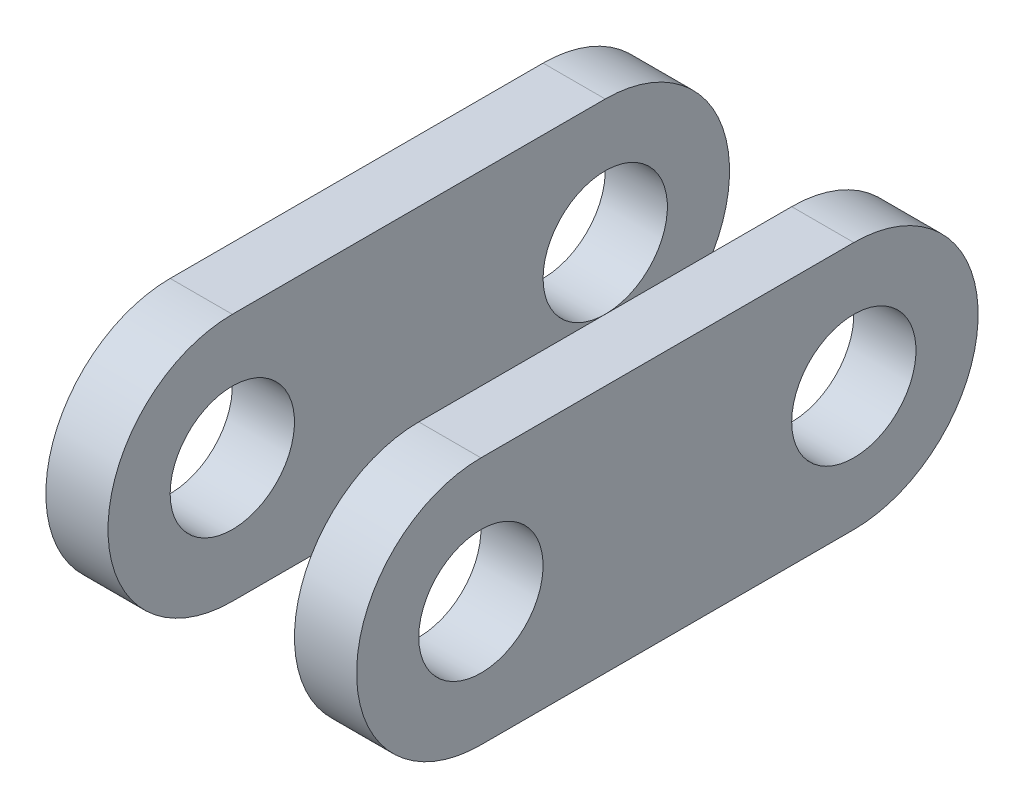
ISO-10303-21;
HEADER;
FILE_DESCRIPTION(('STEP AP214'),'2;1');
FILE_NAME('part.step','',(''),(''),'','','');
FILE_SCHEMA(('AUTOMOTIVE_DESIGN { 1 0 10303 214 1 1 1 1 }'));
ENDSEC;
DATA;
#1=APPLICATION_CONTEXT('core data for automotive mechanical design processes');
#2=APPLICATION_PROTOCOL_DEFINITION('international standard','automotive_design',2000,#1);
#3=PRODUCT_CONTEXT('',#1,'mechanical');
#4=PRODUCT('Part','Part','',(#3));
#5=PRODUCT_RELATED_PRODUCT_CATEGORY('part','',(#4));
#6=PRODUCT_DEFINITION_FORMATION('','',#4);
#7=PRODUCT_DEFINITION_CONTEXT('part definition',#1,'design');
#8=PRODUCT_DEFINITION('design','',#6,#7);
#9=PRODUCT_DEFINITION_SHAPE('','',#8);
#10=(LENGTH_UNIT() NAMED_UNIT(*) SI_UNIT(.MILLI.,.METRE.));
#11=(NAMED_UNIT(*) PLANE_ANGLE_UNIT() SI_UNIT($,.RADIAN.));
#12=(NAMED_UNIT(*) SI_UNIT($,.STERADIAN.) SOLID_ANGLE_UNIT());
#13=UNCERTAINTY_MEASURE_WITH_UNIT(LENGTH_MEASURE(1.E-05),#10,'distance_accuracy_value','');
#14=(GEOMETRIC_REPRESENTATION_CONTEXT(3) GLOBAL_UNCERTAINTY_ASSIGNED_CONTEXT((#13)) GLOBAL_UNIT_ASSIGNED_CONTEXT((#10,
#11,#12)) REPRESENTATION_CONTEXT('',''));
#15=CARTESIAN_POINT('',(0.,0.,0.));
#16=DIRECTION('',(0.,0.,1.));
#17=DIRECTION('',(1.,0.,0.));
#18=AXIS2_PLACEMENT_3D('',#15,#16,#17);
#19=CARTESIAN_POINT('',(1.,0.,0.));
#20=DIRECTION('',(1.,0.,0.));
#21=DIRECTION('',(0.,0.,-1.));
#22=AXIS2_PLACEMENT_3D('',#19,#20,#21);
#23=PLANE('',#22);
#24=CARTESIAN_POINT('',(1.,0.,-6.));
#25=DIRECTION('',(-1.,0.,0.));
#26=DIRECTION('',(0.,0.,1.));
#27=AXIS2_PLACEMENT_3D('',#24,#25,#26);
#28=CIRCLE('',#27,1.);
#29=CARTESIAN_POINT('',(1.,0.,-5.));
#30=VERTEX_POINT('',#29);
#31=EDGE_CURVE('P0_E90',#30,#30,#28,.T.);
#32=ORIENTED_EDGE('',*,*,#31,.T.);
#33=EDGE_LOOP('',(#32));
#34=FACE_BOUND('',#33,.T.);
#35=CARTESIAN_POINT('',(1.,0.,-6.));
#36=DIRECTION('',(-1.,0.,0.));
#37=DIRECTION('',(0.,0.,1.));
#38=AXIS2_PLACEMENT_3D('',#35,#36,#37);
#39=CIRCLE('',#38,2.);
#40=CARTESIAN_POINT('',(1.,2.,-6.));
#41=VERTEX_POINT('',#40);
#42=CARTESIAN_POINT('',(1.,-2.,-6.));
#43=VERTEX_POINT('',#42);
#44=EDGE_CURVE('P0_E19',#41,#43,#39,.T.);
#45=ORIENTED_EDGE('',*,*,#44,.F.);
#46=DIRECTION('',(0.,0.,-1.));
#47=VECTOR('',#46,1.);
#48=CARTESIAN_POINT('',(1.,2.,0.));
#49=LINE('',#48,#47);
#50=CARTESIAN_POINT('',(1.,2.,0.));
#51=VERTEX_POINT('',#50);
#52=EDGE_CURVE('P0_E64',#41,#51,#49,.F.);
#53=ORIENTED_EDGE('',*,*,#52,.T.);
#54=CARTESIAN_POINT('',(1.,0.,0.));
#55=DIRECTION('',(-1.,0.,0.));
#56=DIRECTION('',(0.,0.,1.));
#57=AXIS2_PLACEMENT_3D('',#54,#55,#56);
#58=CIRCLE('',#57,2.);
#59=CARTESIAN_POINT('',(1.,-2.,0.));
#60=VERTEX_POINT('',#59);
#61=EDGE_CURVE('P0_E58',#60,#51,#58,.T.);
#62=ORIENTED_EDGE('',*,*,#61,.F.);
#63=DIRECTION('',(0.,0.,1.));
#64=VECTOR('',#63,1.);
#65=CARTESIAN_POINT('',(1.,-2.,0.));
#66=LINE('',#65,#64);
#67=EDGE_CURVE('P0_E61',#60,#43,#66,.F.);
#68=ORIENTED_EDGE('',*,*,#67,.T.);
#69=EDGE_LOOP('',(#45,#53,#62,#68));
#70=FACE_BOUND('',#69,.T.);
#71=CARTESIAN_POINT('',(1.,0.,0.));
#72=DIRECTION('',(-1.,0.,0.));
#73=DIRECTION('',(0.,0.,1.));
#74=AXIS2_PLACEMENT_3D('',#71,#72,#73);
#75=CIRCLE('',#74,1.);
#76=CARTESIAN_POINT('',(1.,0.,1.));
#77=VERTEX_POINT('',#76);
#78=EDGE_CURVE('P0_E93',#77,#77,#75,.T.);
#79=ORIENTED_EDGE('',*,*,#78,.T.);
#80=EDGE_LOOP('',(#79));
#81=FACE_BOUND('',#80,.T.);
#82=ADVANCED_FACE('P0_F16',(#34,#70,#81),#23,.T.);
#83=CARTESIAN_POINT('',(1.,-2.,0.));
#84=DIRECTION('',(0.,1.,0.));
#85=DIRECTION('',(0.,0.,1.));
#86=AXIS2_PLACEMENT_3D('',#83,#84,#85);
#87=PLANE('',#86);
#88=DIRECTION('',(-1.,0.,0.));
#89=VECTOR('',#88,1.);
#90=CARTESIAN_POINT('',(1.,-2.,-6.));
#91=LINE('',#90,#89);
#92=CARTESIAN_POINT('',(0.,-2.,-6.));
#93=VERTEX_POINT('',#92);
#94=EDGE_CURVE('P0_E73',#43,#93,#91,.T.);
#95=ORIENTED_EDGE('',*,*,#94,.F.);
#96=ORIENTED_EDGE('',*,*,#67,.F.);
#97=DIRECTION('',(1.,0.,0.));
#98=VECTOR('',#97,1.);
#99=CARTESIAN_POINT('',(1.,-2.,0.));
#100=LINE('',#99,#98);
#101=CARTESIAN_POINT('',(0.,-2.,0.));
#102=VERTEX_POINT('',#101);
#103=EDGE_CURVE('P0_E72',#102,#60,#100,.T.);
#104=ORIENTED_EDGE('',*,*,#103,.F.);
#105=DIRECTION('',(0.,0.,-1.));
#106=VECTOR('',#105,1.);
#107=CARTESIAN_POINT('',(0.,-2.,0.));
#108=LINE('',#107,#106);
#109=EDGE_CURVE('P0_E88',#102,#93,#108,.T.);
#110=ORIENTED_EDGE('',*,*,#109,.T.);
#111=EDGE_LOOP('',(#95,#96,#104,#110));
#112=FACE_BOUND('',#111,.T.);
#113=ADVANCED_FACE('P0_F70',(#112),#87,.F.);
#114=CARTESIAN_POINT('',(1.,0.,-6.));
#115=DIRECTION('',(-1.,0.,0.));
#116=DIRECTION('',(0.,0.,1.));
#117=AXIS2_PLACEMENT_3D('',#114,#115,#116);
#118=CYLINDRICAL_SURFACE('',#117,2.);
#119=ORIENTED_EDGE('',*,*,#44,.T.);
#120=ORIENTED_EDGE('',*,*,#94,.T.);
#121=CARTESIAN_POINT('',(0.,0.,-6.));
#122=DIRECTION('',(-1.,0.,0.));
#123=DIRECTION('',(0.,0.,1.));
#124=AXIS2_PLACEMENT_3D('',#121,#122,#123);
#125=CIRCLE('',#124,2.);
#126=CARTESIAN_POINT('',(0.,2.,-6.));
#127=VERTEX_POINT('',#126);
#128=EDGE_CURVE('P0_E85',#93,#127,#125,.F.);
#129=ORIENTED_EDGE('',*,*,#128,.T.);
#130=DIRECTION('',(1.,0.,0.));
#131=VECTOR('',#130,1.);
#132=CARTESIAN_POINT('',(1.,2.,-6.));
#133=LINE('',#132,#131);
#134=EDGE_CURVE('P0_E80',#127,#41,#133,.T.);
#135=ORIENTED_EDGE('',*,*,#134,.T.);
#136=EDGE_LOOP('',(#119,#120,#129,#135));
#137=FACE_BOUND('',#136,.T.);
#138=ADVANCED_FACE('P0_F101',(#137),#118,.T.);
#139=CARTESIAN_POINT('',(1.,2.,0.));
#140=DIRECTION('',(0.,-1.,0.));
#141=DIRECTION('',(0.,0.,-1.));
#142=AXIS2_PLACEMENT_3D('',#139,#140,#141);
#143=PLANE('',#142);
#144=DIRECTION('',(-1.,0.,0.));
#145=VECTOR('',#144,1.);
#146=CARTESIAN_POINT('',(1.,2.,0.));
#147=LINE('',#146,#145);
#148=CARTESIAN_POINT('',(0.,2.,0.));
#149=VERTEX_POINT('',#148);
#150=EDGE_CURVE('P0_E68',#51,#149,#147,.T.);
#151=ORIENTED_EDGE('',*,*,#150,.F.);
#152=ORIENTED_EDGE('',*,*,#52,.F.);
#153=ORIENTED_EDGE('',*,*,#134,.F.);
#154=DIRECTION('',(0.,0.,-1.));
#155=VECTOR('',#154,1.);
#156=CARTESIAN_POINT('',(0.,2.,0.));
#157=LINE('',#156,#155);
#158=EDGE_CURVE('P0_E84',#127,#149,#157,.F.);
#159=ORIENTED_EDGE('',*,*,#158,.T.);
#160=EDGE_LOOP('',(#151,#152,#153,#159));
#161=FACE_BOUND('',#160,.T.);
#162=ADVANCED_FACE('P0_F104',(#161),#143,.F.);
#163=CARTESIAN_POINT('',(1.,0.,0.));
#164=DIRECTION('',(-1.,0.,0.));
#165=DIRECTION('',(0.,0.,1.));
#166=AXIS2_PLACEMENT_3D('',#163,#164,#165);
#167=CYLINDRICAL_SURFACE('',#166,2.);
#168=ORIENTED_EDGE('',*,*,#150,.T.);
#169=CARTESIAN_POINT('',(0.,0.,0.));
#170=DIRECTION('',(-1.,0.,0.));
#171=DIRECTION('',(0.,0.,1.));
#172=AXIS2_PLACEMENT_3D('',#169,#170,#171);
#173=CIRCLE('',#172,2.);
#174=EDGE_CURVE('P0_E34',#149,#102,#173,.F.);
#175=ORIENTED_EDGE('',*,*,#174,.T.);
#176=ORIENTED_EDGE('',*,*,#103,.T.);
#177=ORIENTED_EDGE('',*,*,#61,.T.);
#178=EDGE_LOOP('',(#168,#175,#176,#177));
#179=FACE_BOUND('',#178,.T.);
#180=ADVANCED_FACE('P0_F75',(#179),#167,.T.);
#181=CARTESIAN_POINT('',(1.,0.,0.));
#182=DIRECTION('',(-1.,0.,0.));
#183=DIRECTION('',(0.,0.,1.));
#184=AXIS2_PLACEMENT_3D('',#181,#182,#183);
#185=CYLINDRICAL_SURFACE('',#184,1.);
#186=CARTESIAN_POINT('',(0.,0.,0.));
#187=DIRECTION('',(-1.,0.,0.));
#188=DIRECTION('',(0.,0.,1.));
#189=AXIS2_PLACEMENT_3D('',#186,#187,#188);
#190=CIRCLE('',#189,1.);
#191=CARTESIAN_POINT('',(0.,0.,1.));
#192=VERTEX_POINT('',#191);
#193=EDGE_CURVE('P0_E25',#192,#192,#190,.T.);
#194=ORIENTED_EDGE('',*,*,#193,.T.);
#195=EDGE_LOOP('',(#194));
#196=FACE_BOUND('',#195,.T.);
#197=ORIENTED_EDGE('',*,*,#78,.F.);
#198=EDGE_LOOP('',(#197));
#199=FACE_BOUND('',#198,.T.);
#200=ADVANCED_FACE('P0_F112',(#196,#199),#185,.F.);
#201=CARTESIAN_POINT('',(1.,0.,-6.));
#202=DIRECTION('',(-1.,0.,0.));
#203=DIRECTION('',(0.,0.,1.));
#204=AXIS2_PLACEMENT_3D('',#201,#202,#203);
#205=CYLINDRICAL_SURFACE('',#204,1.);
#206=CARTESIAN_POINT('',(0.,0.,-6.));
#207=DIRECTION('',(-1.,0.,0.));
#208=DIRECTION('',(0.,0.,1.));
#209=AXIS2_PLACEMENT_3D('',#206,#207,#208);
#210=CIRCLE('',#209,1.);
#211=CARTESIAN_POINT('',(0.,0.,-5.));
#212=VERTEX_POINT('',#211);
#213=EDGE_CURVE('P0_E11',#212,#212,#210,.T.);
#214=ORIENTED_EDGE('',*,*,#213,.T.);
#215=EDGE_LOOP('',(#214));
#216=FACE_BOUND('',#215,.T.);
#217=ORIENTED_EDGE('',*,*,#31,.F.);
#218=EDGE_LOOP('',(#217));
#219=FACE_BOUND('',#218,.T.);
#220=ADVANCED_FACE('P0_F116',(#216,#219),#205,.F.);
#221=CARTESIAN_POINT('',(0.,0.,0.));
#222=DIRECTION('',(1.,0.,0.));
#223=DIRECTION('',(0.,0.,-1.));
#224=AXIS2_PLACEMENT_3D('',#221,#222,#223);
#225=PLANE('',#224);
#226=ORIENTED_EDGE('',*,*,#213,.F.);
#227=EDGE_LOOP('',(#226));
#228=FACE_BOUND('',#227,.T.);
#229=ORIENTED_EDGE('',*,*,#193,.F.);
#230=EDGE_LOOP('',(#229));
#231=FACE_BOUND('',#230,.T.);
#232=ORIENTED_EDGE('',*,*,#158,.F.);
#233=ORIENTED_EDGE('',*,*,#128,.F.);
#234=ORIENTED_EDGE('',*,*,#109,.F.);
#235=ORIENTED_EDGE('',*,*,#174,.F.);
#236=EDGE_LOOP('',(#232,#233,#234,#235));
#237=FACE_BOUND('',#236,.T.);
#238=ADVANCED_FACE('P0_F102',(#228,#231,#237),#225,.F.);
#239=CLOSED_SHELL('',(#82,#113,#138,#162,#180,#200,#220,#238));
#240=MANIFOLD_SOLID_BREP('P0_B1',#239);
#241=CARTESIAN_POINT('',(5.,0.,0.));
#242=DIRECTION('',(1.,0.,0.));
#243=DIRECTION('',(0.,0.,-1.));
#244=AXIS2_PLACEMENT_3D('',#241,#242,#243);
#245=PLANE('',#244);
#246=CARTESIAN_POINT('',(5.,0.,-6.));
#247=DIRECTION('',(-1.,0.,0.));
#248=DIRECTION('',(0.,0.,1.));
#249=AXIS2_PLACEMENT_3D('',#246,#247,#248);
#250=CIRCLE('',#249,1.);
#251=CARTESIAN_POINT('',(5.,0.,-5.));
#252=VERTEX_POINT('',#251);
#253=EDGE_CURVE('P1_E90',#252,#252,#250,.T.);
#254=ORIENTED_EDGE('',*,*,#253,.T.);
#255=EDGE_LOOP('',(#254));
#256=FACE_BOUND('',#255,.T.);
#257=CARTESIAN_POINT('',(5.,0.,-6.));
#258=DIRECTION('',(-1.,0.,0.));
#259=DIRECTION('',(0.,0.,1.));
#260=AXIS2_PLACEMENT_3D('',#257,#258,#259);
#261=CIRCLE('',#260,2.);
#262=CARTESIAN_POINT('',(5.,2.,-6.));
#263=VERTEX_POINT('',#262);
#264=CARTESIAN_POINT('',(5.,-2.,-6.));
#265=VERTEX_POINT('',#264);
#266=EDGE_CURVE('P1_E19',#263,#265,#261,.T.);
#267=ORIENTED_EDGE('',*,*,#266,.F.);
#268=DIRECTION('',(0.,0.,-1.));
#269=VECTOR('',#268,1.);
#270=CARTESIAN_POINT('',(5.,2.,0.));
#271=LINE('',#270,#269);
#272=CARTESIAN_POINT('',(5.,2.,0.));
#273=VERTEX_POINT('',#272);
#274=EDGE_CURVE('P1_E64',#263,#273,#271,.F.);
#275=ORIENTED_EDGE('',*,*,#274,.T.);
#276=CARTESIAN_POINT('',(5.,0.,0.));
#277=DIRECTION('',(-1.,0.,0.));
#278=DIRECTION('',(0.,0.,1.));
#279=AXIS2_PLACEMENT_3D('',#276,#277,#278);
#280=CIRCLE('',#279,2.);
#281=CARTESIAN_POINT('',(5.,-2.,0.));
#282=VERTEX_POINT('',#281);
#283=EDGE_CURVE('P1_E58',#282,#273,#280,.T.);
#284=ORIENTED_EDGE('',*,*,#283,.F.);
#285=DIRECTION('',(0.,0.,1.));
#286=VECTOR('',#285,1.);
#287=CARTESIAN_POINT('',(5.,-2.,0.));
#288=LINE('',#287,#286);
#289=EDGE_CURVE('P1_E61',#282,#265,#288,.F.);
#290=ORIENTED_EDGE('',*,*,#289,.T.);
#291=EDGE_LOOP('',(#267,#275,#284,#290));
#292=FACE_BOUND('',#291,.T.);
#293=CARTESIAN_POINT('',(5.,0.,0.));
#294=DIRECTION('',(-1.,0.,0.));
#295=DIRECTION('',(0.,0.,1.));
#296=AXIS2_PLACEMENT_3D('',#293,#294,#295);
#297=CIRCLE('',#296,1.);
#298=CARTESIAN_POINT('',(5.,0.,1.));
#299=VERTEX_POINT('',#298);
#300=EDGE_CURVE('P1_E93',#299,#299,#297,.T.);
#301=ORIENTED_EDGE('',*,*,#300,.T.);
#302=EDGE_LOOP('',(#301));
#303=FACE_BOUND('',#302,.T.);
#304=ADVANCED_FACE('P1_F16',(#256,#292,#303),#245,.T.);
#305=CARTESIAN_POINT('',(5.,-2.,0.));
#306=DIRECTION('',(0.,1.,0.));
#307=DIRECTION('',(0.,0.,1.));
#308=AXIS2_PLACEMENT_3D('',#305,#306,#307);
#309=PLANE('',#308);
#310=DIRECTION('',(-1.,0.,0.));
#311=VECTOR('',#310,1.);
#312=CARTESIAN_POINT('',(5.,-2.,-6.));
#313=LINE('',#312,#311);
#314=CARTESIAN_POINT('',(4.,-2.,-6.));
#315=VERTEX_POINT('',#314);
#316=EDGE_CURVE('P1_E73',#265,#315,#313,.T.);
#317=ORIENTED_EDGE('',*,*,#316,.F.);
#318=ORIENTED_EDGE('',*,*,#289,.F.);
#319=DIRECTION('',(1.,0.,0.));
#320=VECTOR('',#319,1.);
#321=CARTESIAN_POINT('',(5.,-2.,0.));
#322=LINE('',#321,#320);
#323=CARTESIAN_POINT('',(4.,-2.,0.));
#324=VERTEX_POINT('',#323);
#325=EDGE_CURVE('P1_E72',#324,#282,#322,.T.);
#326=ORIENTED_EDGE('',*,*,#325,.F.);
#327=DIRECTION('',(0.,0.,-1.));
#328=VECTOR('',#327,1.);
#329=CARTESIAN_POINT('',(4.,-2.,0.));
#330=LINE('',#329,#328);
#331=EDGE_CURVE('P1_E88',#324,#315,#330,.T.);
#332=ORIENTED_EDGE('',*,*,#331,.T.);
#333=EDGE_LOOP('',(#317,#318,#326,#332));
#334=FACE_BOUND('',#333,.T.);
#335=ADVANCED_FACE('P1_F70',(#334),#309,.F.);
#336=CARTESIAN_POINT('',(5.,0.,-6.));
#337=DIRECTION('',(-1.,0.,0.));
#338=DIRECTION('',(0.,0.,1.));
#339=AXIS2_PLACEMENT_3D('',#336,#337,#338);
#340=CYLINDRICAL_SURFACE('',#339,2.);
#341=ORIENTED_EDGE('',*,*,#266,.T.);
#342=ORIENTED_EDGE('',*,*,#316,.T.);
#343=CARTESIAN_POINT('',(4.,0.,-6.));
#344=DIRECTION('',(-1.,0.,0.));
#345=DIRECTION('',(0.,0.,1.));
#346=AXIS2_PLACEMENT_3D('',#343,#344,#345);
#347=CIRCLE('',#346,2.);
#348=CARTESIAN_POINT('',(4.,2.,-6.));
#349=VERTEX_POINT('',#348);
#350=EDGE_CURVE('P1_E85',#315,#349,#347,.F.);
#351=ORIENTED_EDGE('',*,*,#350,.T.);
#352=DIRECTION('',(1.,0.,0.));
#353=VECTOR('',#352,1.);
#354=CARTESIAN_POINT('',(5.,2.,-6.));
#355=LINE('',#354,#353);
#356=EDGE_CURVE('P1_E80',#349,#263,#355,.T.);
#357=ORIENTED_EDGE('',*,*,#356,.T.);
#358=EDGE_LOOP('',(#341,#342,#351,#357));
#359=FACE_BOUND('',#358,.T.);
#360=ADVANCED_FACE('P1_F101',(#359),#340,.T.);
#361=CARTESIAN_POINT('',(5.,2.,0.));
#362=DIRECTION('',(0.,-1.,0.));
#363=DIRECTION('',(0.,0.,-1.));
#364=AXIS2_PLACEMENT_3D('',#361,#362,#363);
#365=PLANE('',#364);
#366=DIRECTION('',(-1.,0.,0.));
#367=VECTOR('',#366,1.);
#368=CARTESIAN_POINT('',(5.,2.,0.));
#369=LINE('',#368,#367);
#370=CARTESIAN_POINT('',(4.,2.,0.));
#371=VERTEX_POINT('',#370);
#372=EDGE_CURVE('P1_E68',#273,#371,#369,.T.);
#373=ORIENTED_EDGE('',*,*,#372,.F.);
#374=ORIENTED_EDGE('',*,*,#274,.F.);
#375=ORIENTED_EDGE('',*,*,#356,.F.);
#376=DIRECTION('',(0.,0.,-1.));
#377=VECTOR('',#376,1.);
#378=CARTESIAN_POINT('',(4.,2.,0.));
#379=LINE('',#378,#377);
#380=EDGE_CURVE('P1_E84',#349,#371,#379,.F.);
#381=ORIENTED_EDGE('',*,*,#380,.T.);
#382=EDGE_LOOP('',(#373,#374,#375,#381));
#383=FACE_BOUND('',#382,.T.);
#384=ADVANCED_FACE('P1_F104',(#383),#365,.F.);
#385=CARTESIAN_POINT('',(5.,0.,0.));
#386=DIRECTION('',(-1.,0.,0.));
#387=DIRECTION('',(0.,0.,1.));
#388=AXIS2_PLACEMENT_3D('',#385,#386,#387);
#389=CYLINDRICAL_SURFACE('',#388,2.);
#390=ORIENTED_EDGE('',*,*,#372,.T.);
#391=CARTESIAN_POINT('',(4.,0.,0.));
#392=DIRECTION('',(-1.,0.,0.));
#393=DIRECTION('',(0.,0.,1.));
#394=AXIS2_PLACEMENT_3D('',#391,#392,#393);
#395=CIRCLE('',#394,2.);
#396=EDGE_CURVE('P1_E34',#371,#324,#395,.F.);
#397=ORIENTED_EDGE('',*,*,#396,.T.);
#398=ORIENTED_EDGE('',*,*,#325,.T.);
#399=ORIENTED_EDGE('',*,*,#283,.T.);
#400=EDGE_LOOP('',(#390,#397,#398,#399));
#401=FACE_BOUND('',#400,.T.);
#402=ADVANCED_FACE('P1_F75',(#401),#389,.T.);
#403=CARTESIAN_POINT('',(5.,0.,0.));
#404=DIRECTION('',(-1.,0.,0.));
#405=DIRECTION('',(0.,0.,1.));
#406=AXIS2_PLACEMENT_3D('',#403,#404,#405);
#407=CYLINDRICAL_SURFACE('',#406,1.);
#408=CARTESIAN_POINT('',(4.,0.,0.));
#409=DIRECTION('',(-1.,0.,0.));
#410=DIRECTION('',(0.,0.,1.));
#411=AXIS2_PLACEMENT_3D('',#408,#409,#410);
#412=CIRCLE('',#411,1.);
#413=CARTESIAN_POINT('',(4.,0.,1.));
#414=VERTEX_POINT('',#413);
#415=EDGE_CURVE('P1_E25',#414,#414,#412,.T.);
#416=ORIENTED_EDGE('',*,*,#415,.T.);
#417=EDGE_LOOP('',(#416));
#418=FACE_BOUND('',#417,.T.);
#419=ORIENTED_EDGE('',*,*,#300,.F.);
#420=EDGE_LOOP('',(#419));
#421=FACE_BOUND('',#420,.T.);
#422=ADVANCED_FACE('P1_F112',(#418,#421),#407,.F.);
#423=CARTESIAN_POINT('',(5.,0.,-6.));
#424=DIRECTION('',(-1.,0.,0.));
#425=DIRECTION('',(0.,0.,1.));
#426=AXIS2_PLACEMENT_3D('',#423,#424,#425);
#427=CYLINDRICAL_SURFACE('',#426,1.);
#428=CARTESIAN_POINT('',(4.,0.,-6.));
#429=DIRECTION('',(-1.,0.,0.));
#430=DIRECTION('',(0.,0.,1.));
#431=AXIS2_PLACEMENT_3D('',#428,#429,#430);
#432=CIRCLE('',#431,1.);
#433=CARTESIAN_POINT('',(4.,0.,-5.));
#434=VERTEX_POINT('',#433);
#435=EDGE_CURVE('P1_E11',#434,#434,#432,.T.);
#436=ORIENTED_EDGE('',*,*,#435,.T.);
#437=EDGE_LOOP('',(#436));
#438=FACE_BOUND('',#437,.T.);
#439=ORIENTED_EDGE('',*,*,#253,.F.);
#440=EDGE_LOOP('',(#439));
#441=FACE_BOUND('',#440,.T.);
#442=ADVANCED_FACE('P1_F116',(#438,#441),#427,.F.);
#443=CARTESIAN_POINT('',(4.,0.,0.));
#444=DIRECTION('',(1.,0.,0.));
#445=DIRECTION('',(0.,0.,-1.));
#446=AXIS2_PLACEMENT_3D('',#443,#444,#445);
#447=PLANE('',#446);
#448=ORIENTED_EDGE('',*,*,#435,.F.);
#449=EDGE_LOOP('',(#448));
#450=FACE_BOUND('',#449,.T.);
#451=ORIENTED_EDGE('',*,*,#415,.F.);
#452=EDGE_LOOP('',(#451));
#453=FACE_BOUND('',#452,.T.);
#454=ORIENTED_EDGE('',*,*,#380,.F.);
#455=ORIENTED_EDGE('',*,*,#350,.F.);
#456=ORIENTED_EDGE('',*,*,#331,.F.);
#457=ORIENTED_EDGE('',*,*,#396,.F.);
#458=EDGE_LOOP('',(#454,#455,#456,#457));
#459=FACE_BOUND('',#458,.T.);
#460=ADVANCED_FACE('P1_F102',(#450,#453,#459),#447,.F.);
#461=CLOSED_SHELL('',(#304,#335,#360,#384,#402,#422,#442,#460));
#462=MANIFOLD_SOLID_BREP('P1_B1',#461);
#463=ADVANCED_BREP_SHAPE_REPRESENTATION('',(#18,#240,#462),#14);
#464=SHAPE_DEFINITION_REPRESENTATION(#9,#463);
ENDSEC;
END-ISO-10303-21;
